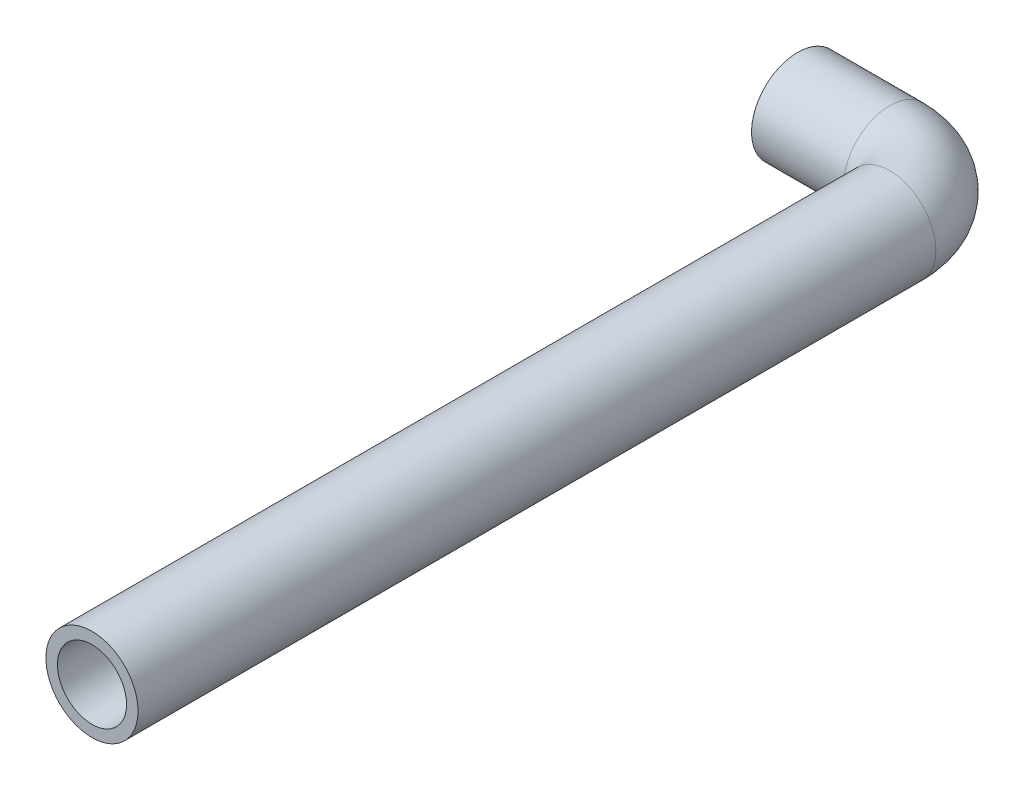
ISO-10303-21;
HEADER;
FILE_DESCRIPTION(('STEP AP214'),'2;1');
FILE_NAME('part.step','',(''),(''),'','','');
FILE_SCHEMA(('AUTOMOTIVE_DESIGN { 1 0 10303 214 1 1 1 1 }'));
ENDSEC;
DATA;
#1=APPLICATION_CONTEXT('core data for automotive mechanical design processes');
#2=APPLICATION_PROTOCOL_DEFINITION('international standard','automotive_design',2000,#1);
#3=PRODUCT_CONTEXT('',#1,'mechanical');
#4=PRODUCT('Part','Part','',(#3));
#5=PRODUCT_RELATED_PRODUCT_CATEGORY('part','',(#4));
#6=PRODUCT_DEFINITION_FORMATION('','',#4);
#7=PRODUCT_DEFINITION_CONTEXT('part definition',#1,'design');
#8=PRODUCT_DEFINITION('design','',#6,#7);
#9=PRODUCT_DEFINITION_SHAPE('','',#8);
#10=(LENGTH_UNIT() NAMED_UNIT(*) SI_UNIT(.MILLI.,.METRE.));
#11=(NAMED_UNIT(*) PLANE_ANGLE_UNIT() SI_UNIT($,.RADIAN.));
#12=(NAMED_UNIT(*) SI_UNIT($,.STERADIAN.) SOLID_ANGLE_UNIT());
#13=UNCERTAINTY_MEASURE_WITH_UNIT(LENGTH_MEASURE(1.E-05),#10,'distance_accuracy_value','');
#14=(GEOMETRIC_REPRESENTATION_CONTEXT(3) GLOBAL_UNCERTAINTY_ASSIGNED_CONTEXT((#13)) GLOBAL_UNIT_ASSIGNED_CONTEXT((#10,
#11,#12)) REPRESENTATION_CONTEXT('',''));
#15=CARTESIAN_POINT('',(0.,0.,0.));
#16=DIRECTION('',(0.,0.,1.));
#17=DIRECTION('',(1.,0.,0.));
#18=AXIS2_PLACEMENT_3D('',#15,#16,#17);
#19=CARTESIAN_POINT('',(20.4748717482189,0.,106.555716131387));
#20=DIRECTION('',(0.,0.,-1.));
#21=DIRECTION('',(-1.,0.,0.));
#22=AXIS2_PLACEMENT_3D('',#19,#20,#21);
#23=CYLINDRICAL_SURFACE('',#22,6.35);
#24=CARTESIAN_POINT('',(20.4748717482189,0.,-3.40984836825466));
#25=DIRECTION('',(0.,0.,1.));
#26=DIRECTION('',(1.,0.,0.));
#27=AXIS2_PLACEMENT_3D('',#24,#25,#26);
#28=CIRCLE('',#27,6.35);
#29=CARTESIAN_POINT('',(26.8248717482189,0.,-3.40984836825464));
#30=VERTEX_POINT('',#29);
#31=EDGE_CURVE('E55',#30,#30,#28,.T.);
#32=ORIENTED_EDGE('',*,*,#31,.T.);
#33=EDGE_LOOP('',(#32));
#34=FACE_BOUND('',#33,.T.);
#35=CARTESIAN_POINT('',(20.4748717482189,0.,106.555716131387));
#36=DIRECTION('',(0.,0.,1.));
#37=DIRECTION('',(1.,0.,0.));
#38=AXIS2_PLACEMENT_3D('',#35,#36,#37);
#39=CIRCLE('',#38,6.35);
#40=CARTESIAN_POINT('',(26.8248717482189,0.,106.555716131387));
#41=VERTEX_POINT('',#40);
#42=EDGE_CURVE('E53',#41,#41,#39,.T.);
#43=ORIENTED_EDGE('',*,*,#42,.F.);
#44=EDGE_LOOP('',(#43));
#45=FACE_BOUND('',#44,.T.);
#46=ADVANCED_FACE('F32',(#34,#45),#23,.T.);
#47=CARTESIAN_POINT('',(12.7,0.,-3.40984836825468));
#48=DIRECTION('',(0.,1.,0.));
#49=DIRECTION('',(0.,0.,1.));
#50=AXIS2_PLACEMENT_3D('',#47,#48,#49);
#51=TOROIDAL_SURFACE('',#50,7.77487174821889,6.35);
#52=CARTESIAN_POINT('',(12.7,0.,-11.1847201164736));
#53=DIRECTION('',(1.,0.,0.));
#54=DIRECTION('',(0.,0.,-1.));
#55=AXIS2_PLACEMENT_3D('',#52,#53,#54);
#56=CIRCLE('',#55,6.35);
#57=CARTESIAN_POINT('',(12.7,0.,-17.5347201164736));
#58=VERTEX_POINT('',#57);
#59=EDGE_CURVE('E36',#58,#58,#56,.T.);
#60=CARTESIAN_POINT('',(12.7,0.,-3.40984836825468));
#61=DIRECTION('',(0.,1.,0.));
#62=DIRECTION('',(0.,0.,1.));
#63=AXIS2_PLACEMENT_3D('',#60,#61,#62);
#64=CIRCLE('',#63,14.1248717482189);
#65=EDGE_CURVE('',#30,#58,#64,.T.);
#66=ORIENTED_EDGE('',*,*,#31,.F.);
#67=ORIENTED_EDGE('',*,*,#59,.T.);
#68=ORIENTED_EDGE('',*,*,#65,.T.);
#69=ORIENTED_EDGE('',*,*,#65,.F.);
#70=EDGE_LOOP('',(#66,#68,#67,#69));
#71=FACE_BOUND('',#70,.T.);
#72=ADVANCED_FACE('F62',(#71),#51,.T.);
#73=CARTESIAN_POINT('',(12.7,0.,-11.1847201164736));
#74=DIRECTION('',(-1.,0.,0.));
#75=DIRECTION('',(0.,0.,1.));
#76=AXIS2_PLACEMENT_3D('',#73,#74,#75);
#77=CYLINDRICAL_SURFACE('',#76,6.35);
#78=CARTESIAN_POINT('',(0.,0.,-11.1847201164736));
#79=DIRECTION('',(1.,0.,0.));
#80=DIRECTION('',(0.,0.,-1.));
#81=AXIS2_PLACEMENT_3D('',#78,#79,#80);
#82=CIRCLE('',#81,6.35);
#83=CARTESIAN_POINT('',(0.,0.,-17.5347201164736));
#84=VERTEX_POINT('',#83);
#85=EDGE_CURVE('E49',#84,#84,#82,.T.);
#86=ORIENTED_EDGE('',*,*,#85,.T.);
#87=EDGE_LOOP('',(#86));
#88=FACE_BOUND('',#87,.T.);
#89=ORIENTED_EDGE('',*,*,#59,.F.);
#90=EDGE_LOOP('',(#89));
#91=FACE_BOUND('',#90,.T.);
#92=ADVANCED_FACE('F34',(#88,#91),#77,.T.);
#93=CARTESIAN_POINT('',(20.4748717482189,0.,106.555716131387));
#94=DIRECTION('',(0.,0.,1.));
#95=DIRECTION('',(1.,0.,0.));
#96=AXIS2_PLACEMENT_3D('',#93,#94,#95);
#97=PLANE('',#96);
#98=CARTESIAN_POINT('',(20.4748717482189,0.,106.555716131387));
#99=DIRECTION('',(0.,0.,1.));
#100=DIRECTION('',(1.,0.,0.));
#101=AXIS2_PLACEMENT_3D('',#98,#99,#100);
#102=CIRCLE('',#101,4.7625);
#103=CARTESIAN_POINT('',(25.2373717482189,0.,106.555716131387));
#104=VERTEX_POINT('',#103);
#105=EDGE_CURVE('E52',#104,#104,#102,.F.);
#106=ORIENTED_EDGE('',*,*,#105,.T.);
#107=EDGE_LOOP('',(#106));
#108=FACE_BOUND('',#107,.T.);
#109=ORIENTED_EDGE('',*,*,#42,.T.);
#110=EDGE_LOOP('',(#109));
#111=FACE_BOUND('',#110,.T.);
#112=ADVANCED_FACE('F66',(#108,#111),#97,.T.);
#113=CARTESIAN_POINT('',(0.,0.,-11.1847201164736));
#114=DIRECTION('',(1.,0.,0.));
#115=DIRECTION('',(0.,0.,-1.));
#116=AXIS2_PLACEMENT_3D('',#113,#114,#115);
#117=PLANE('',#116);
#118=CARTESIAN_POINT('',(0.,0.,-11.1847201164736));
#119=DIRECTION('',(1.,0.,0.));
#120=DIRECTION('',(0.,0.,-1.));
#121=AXIS2_PLACEMENT_3D('',#118,#119,#120);
#122=CIRCLE('',#121,4.7625);
#123=CARTESIAN_POINT('',(0.,0.,-15.9472201164736));
#124=VERTEX_POINT('',#123);
#125=EDGE_CURVE('E10',#124,#124,#122,.F.);
#126=ORIENTED_EDGE('',*,*,#125,.F.);
#127=EDGE_LOOP('',(#126));
#128=FACE_BOUND('',#127,.T.);
#129=ORIENTED_EDGE('',*,*,#85,.F.);
#130=EDGE_LOOP('',(#129));
#131=FACE_BOUND('',#130,.T.);
#132=ADVANCED_FACE('F72',(#128,#131),#117,.F.);
#133=CARTESIAN_POINT('',(20.4748717482189,0.,106.555716131387));
#134=DIRECTION('',(0.,0.,-1.));
#135=DIRECTION('',(-1.,0.,0.));
#136=AXIS2_PLACEMENT_3D('',#133,#134,#135);
#137=CYLINDRICAL_SURFACE('',#136,4.7625);
#138=CARTESIAN_POINT('',(20.4748717482189,0.,-3.40984836825466));
#139=DIRECTION('',(0.,0.,1.));
#140=DIRECTION('',(1.,0.,0.));
#141=AXIS2_PLACEMENT_3D('',#138,#139,#140);
#142=CIRCLE('',#141,4.7625);
#143=CARTESIAN_POINT('',(25.2373717482189,0.,-3.40984836825464));
#144=VERTEX_POINT('',#143);
#145=EDGE_CURVE('E45',#144,#144,#142,.F.);
#146=ORIENTED_EDGE('',*,*,#145,.T.);
#147=EDGE_LOOP('',(#146));
#148=FACE_BOUND('',#147,.T.);
#149=ORIENTED_EDGE('',*,*,#105,.F.);
#150=EDGE_LOOP('',(#149));
#151=FACE_BOUND('',#150,.T.);
#152=ADVANCED_FACE('F82',(#148,#151),#137,.F.);
#153=CARTESIAN_POINT('',(12.7,0.,-3.40984836825468));
#154=DIRECTION('',(0.,1.,0.));
#155=DIRECTION('',(0.,0.,1.));
#156=AXIS2_PLACEMENT_3D('',#153,#154,#155);
#157=TOROIDAL_SURFACE('',#156,7.77487174821889,4.7625);
#158=CARTESIAN_POINT('',(12.7,0.,-11.1847201164736));
#159=DIRECTION('',(1.,0.,0.));
#160=DIRECTION('',(0.,0.,-1.));
#161=AXIS2_PLACEMENT_3D('',#158,#159,#160);
#162=CIRCLE('',#161,4.7625);
#163=CARTESIAN_POINT('',(12.7,0.,-15.9472201164736));
#164=VERTEX_POINT('',#163);
#165=EDGE_CURVE('E40',#164,#164,#162,.F.);
#166=CARTESIAN_POINT('',(12.7,0.,-3.40984836825468));
#167=DIRECTION('',(0.,1.,0.));
#168=DIRECTION('',(0.,0.,1.));
#169=AXIS2_PLACEMENT_3D('',#166,#167,#168);
#170=CIRCLE('',#169,12.5373717482189);
#171=EDGE_CURVE('',#144,#164,#170,.T.);
#172=ORIENTED_EDGE('',*,*,#145,.F.);
#173=ORIENTED_EDGE('',*,*,#165,.T.);
#174=ORIENTED_EDGE('',*,*,#171,.T.);
#175=ORIENTED_EDGE('',*,*,#171,.F.);
#176=EDGE_LOOP('',(#172,#174,#173,#175));
#177=FACE_BOUND('',#176,.T.);
#178=ADVANCED_FACE('F77',(#177),#157,.F.);
#179=CARTESIAN_POINT('',(12.7,0.,-11.1847201164736));
#180=DIRECTION('',(-1.,0.,0.));
#181=DIRECTION('',(0.,0.,1.));
#182=AXIS2_PLACEMENT_3D('',#179,#180,#181);
#183=CYLINDRICAL_SURFACE('',#182,4.7625);
#184=ORIENTED_EDGE('',*,*,#125,.T.);
#185=EDGE_LOOP('',(#184));
#186=FACE_BOUND('',#185,.T.);
#187=ORIENTED_EDGE('',*,*,#165,.F.);
#188=EDGE_LOOP('',(#187));
#189=FACE_BOUND('',#188,.T.);
#190=ADVANCED_FACE('F75',(#186,#189),#183,.F.);
#191=CLOSED_SHELL('',(#46,#72,#92,#112,#132,#152,#178,#190));
#192=MANIFOLD_SOLID_BREP('B2',#191);
#193=ADVANCED_BREP_SHAPE_REPRESENTATION('',(#18,#192),#14);
#194=SHAPE_DEFINITION_REPRESENTATION(#9,#193);
ENDSEC;
END-ISO-10303-21;
